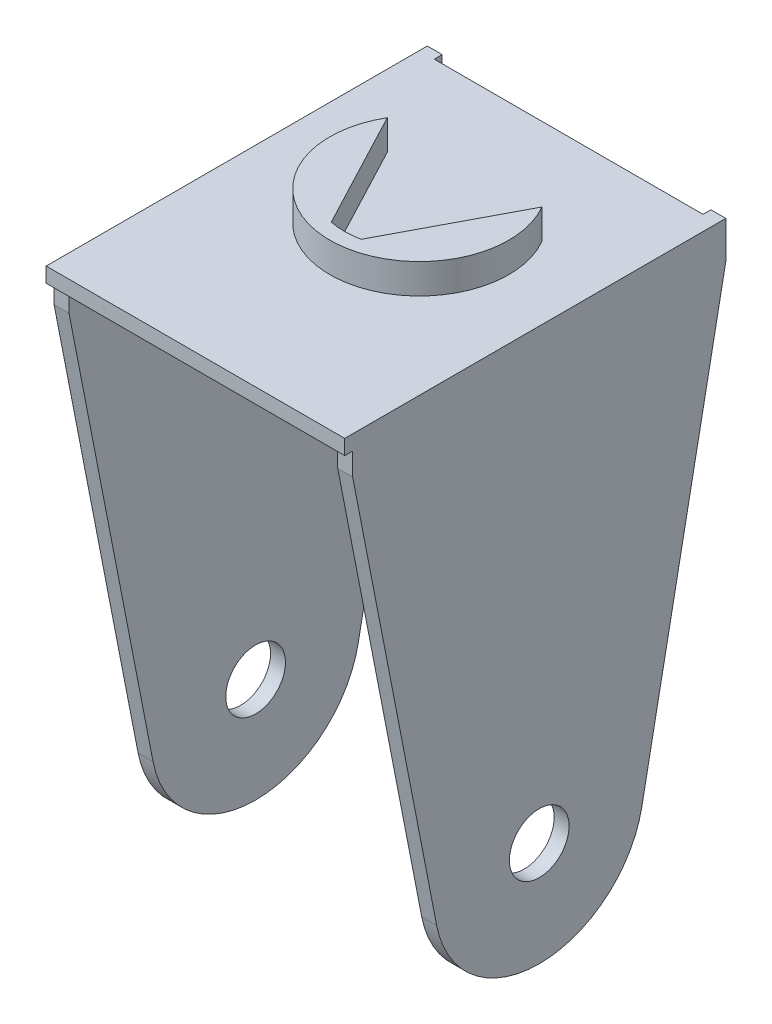
ISO-10303-21;
HEADER;
FILE_DESCRIPTION(('STEP AP214'),'2;1');
FILE_NAME('part.step','',(''),(''),'','','');
FILE_SCHEMA(('AUTOMOTIVE_DESIGN { 1 0 10303 214 1 1 1 1 }'));
ENDSEC;
DATA;
#1=APPLICATION_CONTEXT('core data for automotive mechanical design processes');
#2=APPLICATION_PROTOCOL_DEFINITION('international standard','automotive_design',2000,#1);
#3=PRODUCT_CONTEXT('',#1,'mechanical');
#4=PRODUCT('Part','Part','',(#3));
#5=PRODUCT_RELATED_PRODUCT_CATEGORY('part','',(#4));
#6=PRODUCT_DEFINITION_FORMATION('','',#4);
#7=PRODUCT_DEFINITION_CONTEXT('part definition',#1,'design');
#8=PRODUCT_DEFINITION('design','',#6,#7);
#9=PRODUCT_DEFINITION_SHAPE('','',#8);
#10=(LENGTH_UNIT() NAMED_UNIT(*) SI_UNIT(.MILLI.,.METRE.));
#11=(NAMED_UNIT(*) PLANE_ANGLE_UNIT() SI_UNIT($,.RADIAN.));
#12=(NAMED_UNIT(*) SI_UNIT($,.STERADIAN.) SOLID_ANGLE_UNIT());
#13=UNCERTAINTY_MEASURE_WITH_UNIT(LENGTH_MEASURE(1.E-05),#10,'distance_accuracy_value','');
#14=(GEOMETRIC_REPRESENTATION_CONTEXT(3) GLOBAL_UNCERTAINTY_ASSIGNED_CONTEXT((#13)) GLOBAL_UNIT_ASSIGNED_CONTEXT((#10,
#11,#12)) REPRESENTATION_CONTEXT('',''));
#15=CARTESIAN_POINT('',(0.,0.,0.));
#16=DIRECTION('',(0.,0.,1.));
#17=DIRECTION('',(1.,0.,0.));
#18=AXIS2_PLACEMENT_3D('',#15,#16,#17);
#19=CARTESIAN_POINT('',(-2.,57.2753057698561,0.));
#20=DIRECTION('',(0.,-1.,0.));
#21=DIRECTION('',(0.,0.,-1.));
#22=AXIS2_PLACEMENT_3D('',#19,#20,#21);
#23=PLANE('',#22);
#24=DIRECTION('',(0.,0.,1.));
#25=VECTOR('',#24,1.);
#26=CARTESIAN_POINT('',(-40.,57.2753057698561,-44.4543338172952));
#27=LINE('',#26,#25);
#28=CARTESIAN_POINT('',(-40.,57.2753057698561,-45.5140753862794));
#29=VERTEX_POINT('',#28);
#30=CARTESIAN_POINT('',(-40.,57.2753057698561,5.54566618270477));
#31=VERTEX_POINT('',#30);
#32=EDGE_CURVE('E247',#29,#31,#27,.T.);
#33=ORIENTED_EDGE('',*,*,#32,.T.);
#34=DIRECTION('',(1.,0.,0.));
#35=VECTOR('',#34,1.);
#36=CARTESIAN_POINT('',(-40.,57.2753057698561,5.54566618270477));
#37=LINE('',#36,#35);
#38=CARTESIAN_POINT('',(0.,57.2753057698561,5.54566618270477));
#39=VERTEX_POINT('',#38);
#40=EDGE_CURVE('E262',#31,#39,#37,.T.);
#41=ORIENTED_EDGE('',*,*,#40,.T.);
#42=DIRECTION('',(0.,0.,-1.));
#43=VECTOR('',#42,1.);
#44=CARTESIAN_POINT('',(0.,57.2753057698561,0.));
#45=LINE('',#44,#43);
#46=CARTESIAN_POINT('',(0.,57.2753057698561,-45.5140753862794));
#47=VERTEX_POINT('',#46);
#48=EDGE_CURVE('E305',#39,#47,#45,.T.);
#49=ORIENTED_EDGE('',*,*,#48,.T.);
#50=DIRECTION('',(1.,0.,0.));
#51=VECTOR('',#50,1.);
#52=CARTESIAN_POINT('',(-2.,57.2753057698561,-45.5140753862794));
#53=LINE('',#52,#51);
#54=CARTESIAN_POINT('',(-2.,57.2753057698561,-45.5140753862794));
#55=VERTEX_POINT('',#54);
#56=EDGE_CURVE('E314',#55,#47,#53,.T.);
#57=ORIENTED_EDGE('',*,*,#56,.F.);
#58=DIRECTION('',(0.,0.,-1.));
#59=VECTOR('',#58,1.);
#60=CARTESIAN_POINT('',(-2.,57.2753057698561,0.));
#61=LINE('',#60,#59);
#62=CARTESIAN_POINT('',(-2.,57.2753057698561,-44.4543338172952));
#63=VERTEX_POINT('',#62);
#64=EDGE_CURVE('E290',#63,#55,#61,.T.);
#65=ORIENTED_EDGE('',*,*,#64,.F.);
#66=DIRECTION('',(-1.,0.,0.));
#67=VECTOR('',#66,1.);
#68=CARTESIAN_POINT('',(-40.,57.2753057698561,-44.4543338172952));
#69=LINE('',#68,#67);
#70=CARTESIAN_POINT('',(-38.,57.2753057698561,-44.4543338172952));
#71=VERTEX_POINT('',#70);
#72=EDGE_CURVE('E251',#63,#71,#69,.T.);
#73=ORIENTED_EDGE('',*,*,#72,.T.);
#74=DIRECTION('',(0.,0.,-1.));
#75=VECTOR('',#74,1.);
#76=CARTESIAN_POINT('',(-38.,57.2753057698561,0.));
#77=LINE('',#76,#75);
#78=CARTESIAN_POINT('',(-38.,57.2753057698561,-45.5140753862794));
#79=VERTEX_POINT('',#78);
#80=EDGE_CURVE('E210',#71,#79,#77,.T.);
#81=ORIENTED_EDGE('',*,*,#80,.T.);
#82=DIRECTION('',(-1.,0.,0.));
#83=VECTOR('',#82,1.);
#84=CARTESIAN_POINT('',(-38.,57.2753057698561,-45.5140753862794));
#85=LINE('',#84,#83);
#86=EDGE_CURVE('E234',#79,#29,#85,.T.);
#87=ORIENTED_EDGE('',*,*,#86,.T.);
#88=EDGE_LOOP('',(#33,#41,#49,#57,#65,#73,#81,#87));
#89=FACE_BOUND('',#88,.T.);
#90=CARTESIAN_POINT('',(-20.,57.2753057698561,-24.4518975597883));
#91=DIRECTION('',(0.,-1.,0.));
#92=DIRECTION('',(0.,0.,1.));
#93=AXIS2_PLACEMENT_3D('',#90,#91,#92);
#94=CIRCLE('',#93,10.);
#95=CARTESIAN_POINT('',(-18.,57.2753057698561,-14.6539385886556));
#96=VERTEX_POINT('',#95);
#97=CARTESIAN_POINT('',(-22.,57.2753057698561,-14.6539385886556));
#98=VERTEX_POINT('',#97);
#99=EDGE_CURVE('E51',#96,#98,#94,.T.);
#100=ORIENTED_EDGE('',*,*,#99,.F.);
#101=DIRECTION('',(-0.466127174450924,0.,0.884717727435365));
#102=VECTOR('',#101,1.);
#103=CARTESIAN_POINT('',(-18.,57.2753057698561,-14.6539385886556));
#104=LINE('',#103,#102);
#105=CARTESIAN_POINT('',(-9.64384241139601,57.2753057698561,-30.5140753862794));
#106=VERTEX_POINT('',#105);
#107=EDGE_CURVE('E55',#106,#96,#104,.T.);
#108=ORIENTED_EDGE('',*,*,#107,.F.);
#109=CARTESIAN_POINT('',(-20.,57.2753057698561,-24.4518975597883));
#110=DIRECTION('',(0.,1.,0.));
#111=DIRECTION('',(0.,0.,1.));
#112=AXIS2_PLACEMENT_3D('',#109,#110,#111);
#113=CIRCLE('',#112,12.);
#114=CARTESIAN_POINT('',(-30.356157588604,57.2753057698561,-30.5140753862794));
#115=VERTEX_POINT('',#114);
#116=EDGE_CURVE('E461',#115,#106,#113,.T.);
#117=ORIENTED_EDGE('',*,*,#116,.F.);
#118=DIRECTION('',(-0.466127174450924,0.,-0.884717727435365));
#119=VECTOR('',#118,1.);
#120=CARTESIAN_POINT('',(-22.,57.2753057698561,-14.6539385886556));
#121=LINE('',#120,#119);
#122=EDGE_CURVE('E459',#98,#115,#121,.T.);
#123=ORIENTED_EDGE('',*,*,#122,.F.);
#124=EDGE_LOOP('',(#100,#108,#117,#123));
#125=FACE_BOUND('',#124,.T.);
#126=ADVANCED_FACE('F35',(#89,#125),#23,.F.);
#127=CARTESIAN_POINT('',(-40.,55.2753057698561,-44.4543338172952));
#128=DIRECTION('',(0.,0.,-1.));
#129=DIRECTION('',(-1.,0.,0.));
#130=AXIS2_PLACEMENT_3D('',#127,#128,#129);
#131=PLANE('',#130);
#132=DIRECTION('',(-1.,0.,0.));
#133=VECTOR('',#132,1.);
#134=CARTESIAN_POINT('',(-40.,55.2753057698561,-44.4543338172952));
#135=LINE('',#134,#133);
#136=CARTESIAN_POINT('',(-2.,55.2753057698561,-44.4543338172952));
#137=VERTEX_POINT('',#136);
#138=CARTESIAN_POINT('',(-38.,55.2753057698561,-44.4543338172952));
#139=VERTEX_POINT('',#138);
#140=EDGE_CURVE('E257',#137,#139,#135,.T.);
#141=ORIENTED_EDGE('',*,*,#140,.T.);
#142=DIRECTION('',(0.,1.,0.));
#143=VECTOR('',#142,1.);
#144=CARTESIAN_POINT('',(-38.,55.2753057698561,-44.4543338172952));
#145=LINE('',#144,#143);
#146=EDGE_CURVE('E244',#139,#71,#145,.T.);
#147=ORIENTED_EDGE('',*,*,#146,.T.);
#148=ORIENTED_EDGE('',*,*,#72,.F.);
#149=DIRECTION('',(0.,1.,0.));
#150=VECTOR('',#149,1.);
#151=CARTESIAN_POINT('',(-2.,0.,-44.4543338172952));
#152=LINE('',#151,#150);
#153=EDGE_CURVE('E278',#137,#63,#152,.T.);
#154=ORIENTED_EDGE('',*,*,#153,.F.);
#155=EDGE_LOOP('',(#141,#147,#148,#154));
#156=FACE_BOUND('',#155,.T.);
#157=ADVANCED_FACE('F351',(#156),#131,.T.);
#158=CARTESIAN_POINT('',(0.,55.2753057698561,0.));
#159=DIRECTION('',(0.,1.,0.));
#160=DIRECTION('',(0.,0.,1.));
#161=AXIS2_PLACEMENT_3D('',#158,#159,#160);
#162=PLANE('',#161);
#163=DIRECTION('',(-1.,0.,0.));
#164=VECTOR('',#163,1.);
#165=CARTESIAN_POINT('',(0.,55.2753057698561,4.48592461372064));
#166=LINE('',#165,#164);
#167=CARTESIAN_POINT('',(-38.,55.2753057698561,4.48592461372064));
#168=VERTEX_POINT('',#167);
#169=CARTESIAN_POINT('',(-40.,55.2753057698561,4.48592461372063));
#170=VERTEX_POINT('',#169);
#171=EDGE_CURVE('E230',#168,#170,#166,.T.);
#172=ORIENTED_EDGE('',*,*,#171,.F.);
#173=DIRECTION('',(0.,0.,1.));
#174=VECTOR('',#173,1.);
#175=CARTESIAN_POINT('',(-38.,55.2753057698561,0.));
#176=LINE('',#175,#174);
#177=EDGE_CURVE('E11',#139,#168,#176,.T.);
#178=ORIENTED_EDGE('',*,*,#177,.F.);
#179=ORIENTED_EDGE('',*,*,#140,.F.);
#180=DIRECTION('',(0.,0.,1.));
#181=VECTOR('',#180,1.);
#182=CARTESIAN_POINT('',(-2.,55.2753057698561,0.));
#183=LINE('',#182,#181);
#184=CARTESIAN_POINT('',(-2.,55.2753057698561,4.48592461372064));
#185=VERTEX_POINT('',#184);
#186=EDGE_CURVE('E270',#137,#185,#183,.T.);
#187=ORIENTED_EDGE('',*,*,#186,.T.);
#188=DIRECTION('',(1.,0.,0.));
#189=VECTOR('',#188,1.);
#190=CARTESIAN_POINT('',(-2.,55.2753057698561,4.48592461372064));
#191=LINE('',#190,#189);
#192=CARTESIAN_POINT('',(0.,55.2753057698561,4.48592461372064));
#193=VERTEX_POINT('',#192);
#194=EDGE_CURVE('E275',#185,#193,#191,.T.);
#195=ORIENTED_EDGE('',*,*,#194,.T.);
#196=DIRECTION('',(0.,0.,-1.));
#197=VECTOR('',#196,1.);
#198=CARTESIAN_POINT('',(0.,55.2753057698561,-44.4543338172952));
#199=LINE('',#198,#197);
#200=CARTESIAN_POINT('',(0.,55.2753057698561,5.54566618270477));
#201=VERTEX_POINT('',#200);
#202=EDGE_CURVE('E254',#201,#193,#199,.T.);
#203=ORIENTED_EDGE('',*,*,#202,.F.);
#204=DIRECTION('',(1.,0.,0.));
#205=VECTOR('',#204,1.);
#206=CARTESIAN_POINT('',(-40.,55.2753057698561,5.54566618270477));
#207=LINE('',#206,#205);
#208=CARTESIAN_POINT('',(-40.,55.2753057698561,5.54566618270477));
#209=VERTEX_POINT('',#208);
#210=EDGE_CURVE('E250',#209,#201,#207,.T.);
#211=ORIENTED_EDGE('',*,*,#210,.F.);
#212=DIRECTION('',(0.,0.,1.));
#213=VECTOR('',#212,1.);
#214=CARTESIAN_POINT('',(-40.,55.2753057698561,-44.4543338172952));
#215=LINE('',#214,#213);
#216=EDGE_CURVE('E248',#170,#209,#215,.T.);
#217=ORIENTED_EDGE('',*,*,#216,.F.);
#218=EDGE_LOOP('',(#172,#178,#179,#187,#195,#203,#211,#217));
#219=FACE_BOUND('',#218,.T.);
#220=ADVANCED_FACE('F347',(#219),#162,.F.);
#221=CARTESIAN_POINT('',(-2.,0.,4.48592461372065));
#222=DIRECTION('',(0.,0.,-1.));
#223=DIRECTION('',(0.,1.,0.));
#224=AXIS2_PLACEMENT_3D('',#221,#222,#223);
#225=PLANE('',#224);
#226=ORIENTED_EDGE('',*,*,#194,.F.);
#227=DIRECTION('',(0.,1.,0.));
#228=VECTOR('',#227,1.);
#229=CARTESIAN_POINT('',(-2.,0.,4.48592461372065));
#230=LINE('',#229,#228);
#231=CARTESIAN_POINT('',(-2.,52.2753057698561,4.48592461372064));
#232=VERTEX_POINT('',#231);
#233=EDGE_CURVE('E292',#232,#185,#230,.T.);
#234=ORIENTED_EDGE('',*,*,#233,.F.);
#235=DIRECTION('',(1.,0.,0.));
#236=VECTOR('',#235,1.);
#237=CARTESIAN_POINT('',(-2.,52.2753057698561,4.48592461372064));
#238=LINE('',#237,#236);
#239=CARTESIAN_POINT('',(0.,52.2753057698561,4.48592461372064));
#240=VERTEX_POINT('',#239);
#241=EDGE_CURVE('E311',#232,#240,#238,.T.);
#242=ORIENTED_EDGE('',*,*,#241,.T.);
#243=DIRECTION('',(0.,1.,0.));
#244=VECTOR('',#243,1.);
#245=CARTESIAN_POINT('',(0.,0.,4.48592461372065));
#246=LINE('',#245,#244);
#247=EDGE_CURVE('E307',#240,#193,#246,.T.);
#248=ORIENTED_EDGE('',*,*,#247,.T.);
#249=EDGE_LOOP('',(#226,#234,#242,#248));
#250=FACE_BOUND('',#249,.T.);
#251=ADVANCED_FACE('F340',(#250),#225,.F.);
#252=CARTESIAN_POINT('',(-2.,-2.72469423014387,-20.5140753862794));
#253=DIRECTION('',(1.,0.,0.));
#254=DIRECTION('',(0.,0.,-1.));
#255=AXIS2_PLACEMENT_3D('',#252,#253,#254);
#256=CYLINDRICAL_SURFACE('',#255,14.);
#257=CARTESIAN_POINT('',(0.,-2.72469423014387,-20.5140753862794));
#258=DIRECTION('',(1.,0.,0.));
#259=DIRECTION('',(0.,0.,-1.));
#260=AXIS2_PLACEMENT_3D('',#257,#258,#259);
#261=CIRCLE('',#260,14.);
#262=CARTESIAN_POINT('',(0.,-5.40682008134419,-6.77339851363869));
#263=VERTEX_POINT('',#262);
#264=CARTESIAN_POINT('',(0.,-5.40682008134418,-34.2547522589201));
#265=VERTEX_POINT('',#264);
#266=EDGE_CURVE('E281',#263,#265,#261,.T.);
#267=ORIENTED_EDGE('',*,*,#266,.F.);
#268=DIRECTION('',(1.,0.,0.));
#269=VECTOR('',#268,1.);
#270=CARTESIAN_POINT('',(-2.,-5.40682008134419,-6.77339851363869));
#271=LINE('',#270,#269);
#272=CARTESIAN_POINT('',(-2.,-5.40682008134419,-6.77339851363869));
#273=VERTEX_POINT('',#272);
#274=EDGE_CURVE('E44',#273,#263,#271,.T.);
#275=ORIENTED_EDGE('',*,*,#274,.F.);
#276=CARTESIAN_POINT('',(-2.,-2.72469423014387,-20.5140753862794));
#277=DIRECTION('',(1.,0.,0.));
#278=DIRECTION('',(0.,0.,-1.));
#279=AXIS2_PLACEMENT_3D('',#276,#277,#278);
#280=CIRCLE('',#279,14.);
#281=CARTESIAN_POINT('',(-2.,-5.40682008134418,-34.2547522589201));
#282=VERTEX_POINT('',#281);
#283=EDGE_CURVE('E282',#273,#282,#280,.T.);
#284=ORIENTED_EDGE('',*,*,#283,.T.);
#285=DIRECTION('',(1.,0.,0.));
#286=VECTOR('',#285,1.);
#287=CARTESIAN_POINT('',(-2.,-5.40682008134418,-34.2547522589201));
#288=LINE('',#287,#286);
#289=EDGE_CURVE('E297',#282,#265,#288,.T.);
#290=ORIENTED_EDGE('',*,*,#289,.T.);
#291=EDGE_LOOP('',(#267,#275,#284,#290));
#292=FACE_BOUND('',#291,.T.);
#293=ADVANCED_FACE('F37',(#292),#256,.T.);
#294=CARTESIAN_POINT('',(-2.,1.07516720995228,-5.50814019759788));
#295=DIRECTION('',(0.,0.19158041794288,-0.981476919474335));
#296=DIRECTION('',(0.,0.981476919474336,0.19158041794288));
#297=AXIS2_PLACEMENT_3D('',#294,#295,#296);
#298=PLANE('',#297);
#299=DIRECTION('',(0.,0.981476919474336,0.19158041794288));
#300=VECTOR('',#299,1.);
#301=CARTESIAN_POINT('',(0.,1.07516720995228,-5.50814019759788));
#302=LINE('',#301,#300);
#303=EDGE_CURVE('E286',#263,#240,#302,.T.);
#304=ORIENTED_EDGE('',*,*,#303,.T.);
#305=ORIENTED_EDGE('',*,*,#241,.F.);
#306=DIRECTION('',(0.,0.981476919474336,0.19158041794288));
#307=VECTOR('',#306,1.);
#308=CARTESIAN_POINT('',(-2.,1.07516720995228,-5.50814019759788));
#309=LINE('',#308,#307);
#310=EDGE_CURVE('E295',#273,#232,#309,.T.);
#311=ORIENTED_EDGE('',*,*,#310,.F.);
#312=ORIENTED_EDGE('',*,*,#274,.T.);
#313=EDGE_LOOP('',(#304,#305,#311,#312));
#314=FACE_BOUND('',#313,.T.);
#315=ADVANCED_FACE('F336',(#314),#298,.F.);
#316=CARTESIAN_POINT('',(-2.,0.,-45.5140753862794));
#317=DIRECTION('',(0.,0.,1.));
#318=DIRECTION('',(1.,0.,0.));
#319=AXIS2_PLACEMENT_3D('',#316,#317,#318);
#320=PLANE('',#319);
#321=DIRECTION('',(0.,-1.,0.));
#322=VECTOR('',#321,1.);
#323=CARTESIAN_POINT('',(0.,0.,-45.5140753862794));
#324=LINE('',#323,#322);
#325=CARTESIAN_POINT('',(0.,52.2753057698561,-45.5140753862794));
#326=VERTEX_POINT('',#325);
#327=EDGE_CURVE('E303',#47,#326,#324,.T.);
#328=ORIENTED_EDGE('',*,*,#327,.T.);
#329=DIRECTION('',(1.,0.,0.));
#330=VECTOR('',#329,1.);
#331=CARTESIAN_POINT('',(-2.,52.2753057698561,-45.5140753862794));
#332=LINE('',#331,#330);
#333=CARTESIAN_POINT('',(-2.,52.2753057698561,-45.5140753862794));
#334=VERTEX_POINT('',#333);
#335=EDGE_CURVE('E317',#334,#326,#332,.T.);
#336=ORIENTED_EDGE('',*,*,#335,.F.);
#337=DIRECTION('',(0.,-1.,0.));
#338=VECTOR('',#337,1.);
#339=CARTESIAN_POINT('',(-2.,0.,-45.5140753862794));
#340=LINE('',#339,#338);
#341=EDGE_CURVE('E288',#55,#334,#340,.T.);
#342=ORIENTED_EDGE('',*,*,#341,.F.);
#343=ORIENTED_EDGE('',*,*,#56,.T.);
#344=EDGE_LOOP('',(#328,#336,#342,#343));
#345=FACE_BOUND('',#344,.T.);
#346=ADVANCED_FACE('F357',(#345),#320,.F.);
#347=CARTESIAN_POINT('',(-2.,-6.63942812511474,-34.0141520374581));
#348=DIRECTION('',(0.,0.19158041794288,0.981476919474336));
#349=DIRECTION('',(0.,-0.981476919474336,0.19158041794288));
#350=AXIS2_PLACEMENT_3D('',#347,#348,#349);
#351=PLANE('',#350);
#352=DIRECTION('',(0.,-0.981476919474336,0.19158041794288));
#353=VECTOR('',#352,1.);
#354=CARTESIAN_POINT('',(0.,-6.63942812511474,-34.0141520374581));
#355=LINE('',#354,#353);
#356=EDGE_CURVE('E300',#326,#265,#355,.T.);
#357=ORIENTED_EDGE('',*,*,#356,.T.);
#358=ORIENTED_EDGE('',*,*,#289,.F.);
#359=DIRECTION('',(0.,-0.981476919474336,0.19158041794288));
#360=VECTOR('',#359,1.);
#361=CARTESIAN_POINT('',(-2.,-6.63942812511474,-34.0141520374581));
#362=LINE('',#361,#360);
#363=EDGE_CURVE('E285',#334,#282,#362,.T.);
#364=ORIENTED_EDGE('',*,*,#363,.F.);
#365=ORIENTED_EDGE('',*,*,#335,.T.);
#366=EDGE_LOOP('',(#357,#358,#364,#365));
#367=FACE_BOUND('',#366,.T.);
#368=ADVANCED_FACE('F327',(#367),#351,.F.);
#369=CARTESIAN_POINT('',(-2.,0.,0.));
#370=DIRECTION('',(1.,0.,0.));
#371=DIRECTION('',(0.,0.,-1.));
#372=AXIS2_PLACEMENT_3D('',#369,#370,#371);
#373=PLANE('',#372);
#374=CARTESIAN_POINT('',(-2.,-2.72469423014387,-20.5140753862794));
#375=DIRECTION('',(1.,0.,0.));
#376=DIRECTION('',(0.,0.,-1.));
#377=AXIS2_PLACEMENT_3D('',#374,#375,#376);
#378=CIRCLE('',#377,4.);
#379=CARTESIAN_POINT('',(-2.,-2.72469423014387,-24.5140753862794));
#380=VERTEX_POINT('',#379);
#381=EDGE_CURVE('E450',#380,#380,#378,.T.);
#382=ORIENTED_EDGE('',*,*,#381,.T.);
#383=EDGE_LOOP('',(#382));
#384=FACE_BOUND('',#383,.T.);
#385=ORIENTED_EDGE('',*,*,#186,.F.);
#386=ORIENTED_EDGE('',*,*,#153,.T.);
#387=ORIENTED_EDGE('',*,*,#64,.T.);
#388=ORIENTED_EDGE('',*,*,#341,.T.);
#389=ORIENTED_EDGE('',*,*,#363,.T.);
#390=ORIENTED_EDGE('',*,*,#283,.F.);
#391=ORIENTED_EDGE('',*,*,#310,.T.);
#392=ORIENTED_EDGE('',*,*,#233,.T.);
#393=EDGE_LOOP('',(#385,#386,#387,#388,#389,#390,#391,#392));
#394=FACE_BOUND('',#393,.T.);
#395=ADVANCED_FACE('F342',(#384,#394),#373,.F.);
#396=CARTESIAN_POINT('',(0.,0.,0.));
#397=DIRECTION('',(1.,0.,0.));
#398=DIRECTION('',(0.,0.,-1.));
#399=AXIS2_PLACEMENT_3D('',#396,#397,#398);
#400=PLANE('',#399);
#401=CARTESIAN_POINT('',(0.,-2.72469423014387,-20.5140753862794));
#402=DIRECTION('',(1.,0.,0.));
#403=DIRECTION('',(0.,0.,-1.));
#404=AXIS2_PLACEMENT_3D('',#401,#402,#403);
#405=CIRCLE('',#404,4.);
#406=CARTESIAN_POINT('',(0.,-2.72469423014387,-24.5140753862794));
#407=VERTEX_POINT('',#406);
#408=EDGE_CURVE('E447',#407,#407,#405,.T.);
#409=ORIENTED_EDGE('',*,*,#408,.F.);
#410=EDGE_LOOP('',(#409));
#411=FACE_BOUND('',#410,.T.);
#412=ORIENTED_EDGE('',*,*,#327,.F.);
#413=ORIENTED_EDGE('',*,*,#48,.F.);
#414=DIRECTION('',(0.,1.,0.));
#415=VECTOR('',#414,1.);
#416=CARTESIAN_POINT('',(0.,55.2753057698561,5.54566618270477));
#417=LINE('',#416,#415);
#418=EDGE_CURVE('E267',#201,#39,#417,.T.);
#419=ORIENTED_EDGE('',*,*,#418,.F.);
#420=ORIENTED_EDGE('',*,*,#202,.T.);
#421=ORIENTED_EDGE('',*,*,#247,.F.);
#422=ORIENTED_EDGE('',*,*,#303,.F.);
#423=ORIENTED_EDGE('',*,*,#266,.T.);
#424=ORIENTED_EDGE('',*,*,#356,.F.);
#425=EDGE_LOOP('',(#412,#413,#419,#420,#421,#422,#423,#424));
#426=FACE_BOUND('',#425,.T.);
#427=ADVANCED_FACE('F332',(#411,#426),#400,.T.);
#428=CARTESIAN_POINT('',(-40.,55.2753057698561,-44.4543338172952));
#429=DIRECTION('',(-1.,0.,0.));
#430=DIRECTION('',(0.,0.,1.));
#431=AXIS2_PLACEMENT_3D('',#428,#429,#430);
#432=PLANE('',#431);
#433=CARTESIAN_POINT('',(-40.,-2.72469423014387,-20.5140753862794));
#434=DIRECTION('',(1.,0.,0.));
#435=DIRECTION('',(0.,0.,-1.));
#436=AXIS2_PLACEMENT_3D('',#433,#434,#435);
#437=CIRCLE('',#436,4.);
#438=CARTESIAN_POINT('',(-40.,-2.72469423014387,-24.5140753862794));
#439=VERTEX_POINT('',#438);
#440=EDGE_CURVE('E445',#439,#439,#437,.T.);
#441=ORIENTED_EDGE('',*,*,#440,.T.);
#442=EDGE_LOOP('',(#441));
#443=FACE_BOUND('',#442,.T.);
#444=ORIENTED_EDGE('',*,*,#32,.F.);
#445=DIRECTION('',(0.,-1.,0.));
#446=VECTOR('',#445,1.);
#447=CARTESIAN_POINT('',(-40.,0.,-45.5140753862794));
#448=LINE('',#447,#446);
#449=CARTESIAN_POINT('',(-40.,52.2753057698561,-45.5140753862794));
#450=VERTEX_POINT('',#449);
#451=EDGE_CURVE('E220',#29,#450,#448,.T.);
#452=ORIENTED_EDGE('',*,*,#451,.T.);
#453=DIRECTION('',(0.,-0.981476919474336,0.19158041794288));
#454=VECTOR('',#453,1.);
#455=CARTESIAN_POINT('',(-40.,-6.63942812511474,-34.0141520374581));
#456=LINE('',#455,#454);
#457=CARTESIAN_POINT('',(-40.,-5.40682008134418,-34.2547522589201));
#458=VERTEX_POINT('',#457);
#459=EDGE_CURVE('E195',#450,#458,#456,.T.);
#460=ORIENTED_EDGE('',*,*,#459,.T.);
#461=CARTESIAN_POINT('',(-40.,-2.72469423014387,-20.5140753862794));
#462=DIRECTION('',(1.,0.,0.));
#463=DIRECTION('',(0.,0.,-1.));
#464=AXIS2_PLACEMENT_3D('',#461,#462,#463);
#465=CIRCLE('',#464,14.);
#466=CARTESIAN_POINT('',(-40.,-5.40682008134419,-6.77339851363869));
#467=VERTEX_POINT('',#466);
#468=EDGE_CURVE('E192',#467,#458,#465,.T.);
#469=ORIENTED_EDGE('',*,*,#468,.F.);
#470=DIRECTION('',(0.,0.981476919474336,0.19158041794288));
#471=VECTOR('',#470,1.);
#472=CARTESIAN_POINT('',(-40.,1.07516720995228,-5.50814019759788));
#473=LINE('',#472,#471);
#474=CARTESIAN_POINT('',(-40.,52.2753057698561,4.48592461372064));
#475=VERTEX_POINT('',#474);
#476=EDGE_CURVE('E205',#467,#475,#473,.T.);
#477=ORIENTED_EDGE('',*,*,#476,.T.);
#478=DIRECTION('',(0.,1.,0.));
#479=VECTOR('',#478,1.);
#480=CARTESIAN_POINT('',(-40.,0.,4.48592461372065));
#481=LINE('',#480,#479);
#482=EDGE_CURVE('E223',#475,#170,#481,.T.);
#483=ORIENTED_EDGE('',*,*,#482,.T.);
#484=ORIENTED_EDGE('',*,*,#216,.T.);
#485=DIRECTION('',(0.,1.,0.));
#486=VECTOR('',#485,1.);
#487=CARTESIAN_POINT('',(-40.,55.2753057698561,5.54566618270477));
#488=LINE('',#487,#486);
#489=EDGE_CURVE('E260',#209,#31,#488,.T.);
#490=ORIENTED_EDGE('',*,*,#489,.T.);
#491=EDGE_LOOP('',(#444,#452,#460,#469,#477,#483,#484,#490));
#492=FACE_BOUND('',#491,.T.);
#493=ADVANCED_FACE('F366',(#443,#492),#432,.T.);
#494=CARTESIAN_POINT('',(-40.,55.2753057698561,5.54566618270477));
#495=DIRECTION('',(0.,0.,1.));
#496=DIRECTION('',(1.,0.,0.));
#497=AXIS2_PLACEMENT_3D('',#494,#495,#496);
#498=PLANE('',#497);
#499=ORIENTED_EDGE('',*,*,#40,.F.);
#500=ORIENTED_EDGE('',*,*,#489,.F.);
#501=ORIENTED_EDGE('',*,*,#210,.T.);
#502=ORIENTED_EDGE('',*,*,#418,.T.);
#503=EDGE_LOOP('',(#499,#500,#501,#502));
#504=FACE_BOUND('',#503,.T.);
#505=ADVANCED_FACE('F360',(#504),#498,.T.);
#506=CARTESIAN_POINT('',(-38.,0.,4.48592461372065));
#507=DIRECTION('',(0.,0.,-1.));
#508=DIRECTION('',(0.,1.,0.));
#509=AXIS2_PLACEMENT_3D('',#506,#507,#508);
#510=PLANE('',#509);
#511=DIRECTION('',(0.,1.,0.));
#512=VECTOR('',#511,1.);
#513=CARTESIAN_POINT('',(-38.,0.,4.48592461372065));
#514=LINE('',#513,#512);
#515=CARTESIAN_POINT('',(-38.,52.2753057698561,4.48592461372064));
#516=VERTEX_POINT('',#515);
#517=EDGE_CURVE('E212',#516,#168,#514,.T.);
#518=ORIENTED_EDGE('',*,*,#517,.T.);
#519=ORIENTED_EDGE('',*,*,#171,.T.);
#520=ORIENTED_EDGE('',*,*,#482,.F.);
#521=DIRECTION('',(-1.,0.,0.));
#522=VECTOR('',#521,1.);
#523=CARTESIAN_POINT('',(-38.,52.2753057698561,4.48592461372064));
#524=LINE('',#523,#522);
#525=EDGE_CURVE('E231',#516,#475,#524,.T.);
#526=ORIENTED_EDGE('',*,*,#525,.F.);
#527=EDGE_LOOP('',(#518,#519,#520,#526));
#528=FACE_BOUND('',#527,.T.);
#529=ADVANCED_FACE('F369',(#528),#510,.F.);
#530=CARTESIAN_POINT('',(-38.,-2.72469423014387,-20.5140753862794));
#531=DIRECTION('',(-1.,0.,0.));
#532=DIRECTION('',(0.,0.,-1.));
#533=AXIS2_PLACEMENT_3D('',#530,#531,#532);
#534=CYLINDRICAL_SURFACE('',#533,14.);
#535=ORIENTED_EDGE('',*,*,#468,.T.);
#536=DIRECTION('',(-1.,0.,0.));
#537=VECTOR('',#536,1.);
#538=CARTESIAN_POINT('',(-38.,-5.40682008134418,-34.2547522589201));
#539=LINE('',#538,#537);
#540=CARTESIAN_POINT('',(-38.,-5.40682008134418,-34.2547522589201));
#541=VERTEX_POINT('',#540);
#542=EDGE_CURVE('E217',#541,#458,#539,.T.);
#543=ORIENTED_EDGE('',*,*,#542,.F.);
#544=CARTESIAN_POINT('',(-38.,-2.72469423014387,-20.5140753862794));
#545=DIRECTION('',(1.,0.,0.));
#546=DIRECTION('',(0.,0.,-1.));
#547=AXIS2_PLACEMENT_3D('',#544,#545,#546);
#548=CIRCLE('',#547,14.);
#549=CARTESIAN_POINT('',(-38.,-5.40682008134419,-6.77339851363869));
#550=VERTEX_POINT('',#549);
#551=EDGE_CURVE('E201',#550,#541,#548,.T.);
#552=ORIENTED_EDGE('',*,*,#551,.F.);
#553=DIRECTION('',(-1.,0.,0.));
#554=VECTOR('',#553,1.);
#555=CARTESIAN_POINT('',(-38.,-5.40682008134419,-6.77339851363869));
#556=LINE('',#555,#554);
#557=EDGE_CURVE('E227',#550,#467,#556,.T.);
#558=ORIENTED_EDGE('',*,*,#557,.T.);
#559=EDGE_LOOP('',(#535,#543,#552,#558));
#560=FACE_BOUND('',#559,.T.);
#561=ADVANCED_FACE('F384',(#560),#534,.T.);
#562=CARTESIAN_POINT('',(-38.,1.07516720995228,-5.50814019759788));
#563=DIRECTION('',(0.,0.19158041794288,-0.981476919474335));
#564=DIRECTION('',(0.,0.981476919474336,0.19158041794288));
#565=AXIS2_PLACEMENT_3D('',#562,#563,#564);
#566=PLANE('',#565);
#567=ORIENTED_EDGE('',*,*,#476,.F.);
#568=ORIENTED_EDGE('',*,*,#557,.F.);
#569=DIRECTION('',(0.,0.981476919474336,0.19158041794288));
#570=VECTOR('',#569,1.);
#571=CARTESIAN_POINT('',(-38.,1.07516720995228,-5.50814019759788));
#572=LINE('',#571,#570);
#573=EDGE_CURVE('E215',#550,#516,#572,.T.);
#574=ORIENTED_EDGE('',*,*,#573,.T.);
#575=ORIENTED_EDGE('',*,*,#525,.T.);
#576=EDGE_LOOP('',(#567,#568,#574,#575));
#577=FACE_BOUND('',#576,.T.);
#578=ADVANCED_FACE('F386',(#577),#566,.F.);
#579=CARTESIAN_POINT('',(-38.,0.,-45.5140753862794));
#580=DIRECTION('',(0.,0.,1.));
#581=DIRECTION('',(-1.,0.,0.));
#582=AXIS2_PLACEMENT_3D('',#579,#580,#581);
#583=PLANE('',#582);
#584=ORIENTED_EDGE('',*,*,#451,.F.);
#585=ORIENTED_EDGE('',*,*,#86,.F.);
#586=DIRECTION('',(0.,-1.,0.));
#587=VECTOR('',#586,1.);
#588=CARTESIAN_POINT('',(-38.,0.,-45.5140753862794));
#589=LINE('',#588,#587);
#590=CARTESIAN_POINT('',(-38.,52.2753057698561,-45.5140753862794));
#591=VERTEX_POINT('',#590);
#592=EDGE_CURVE('E207',#79,#591,#589,.T.);
#593=ORIENTED_EDGE('',*,*,#592,.T.);
#594=DIRECTION('',(-1.,0.,0.));
#595=VECTOR('',#594,1.);
#596=CARTESIAN_POINT('',(-38.,52.2753057698561,-45.5140753862794));
#597=LINE('',#596,#595);
#598=EDGE_CURVE('E237',#591,#450,#597,.T.);
#599=ORIENTED_EDGE('',*,*,#598,.T.);
#600=EDGE_LOOP('',(#584,#585,#593,#599));
#601=FACE_BOUND('',#600,.T.);
#602=ADVANCED_FACE('F377',(#601),#583,.F.);
#603=CARTESIAN_POINT('',(-38.,-6.63942812511474,-34.0141520374581));
#604=DIRECTION('',(0.,0.19158041794288,0.981476919474336));
#605=DIRECTION('',(0.,-0.981476919474336,0.19158041794288));
#606=AXIS2_PLACEMENT_3D('',#603,#604,#605);
#607=PLANE('',#606);
#608=ORIENTED_EDGE('',*,*,#459,.F.);
#609=ORIENTED_EDGE('',*,*,#598,.F.);
#610=DIRECTION('',(0.,-0.981476919474336,0.19158041794288));
#611=VECTOR('',#610,1.);
#612=CARTESIAN_POINT('',(-38.,-6.63942812511474,-34.0141520374581));
#613=LINE('',#612,#611);
#614=EDGE_CURVE('E204',#591,#541,#613,.T.);
#615=ORIENTED_EDGE('',*,*,#614,.T.);
#616=ORIENTED_EDGE('',*,*,#542,.T.);
#617=EDGE_LOOP('',(#608,#609,#615,#616));
#618=FACE_BOUND('',#617,.T.);
#619=ADVANCED_FACE('F381',(#618),#607,.F.);
#620=CARTESIAN_POINT('',(-38.,0.,0.));
#621=DIRECTION('',(-1.,0.,0.));
#622=DIRECTION('',(0.,0.,-1.));
#623=AXIS2_PLACEMENT_3D('',#620,#621,#622);
#624=PLANE('',#623);
#625=CARTESIAN_POINT('',(-38.,-2.72469423014387,-20.5140753862794));
#626=DIRECTION('',(-1.,0.,0.));
#627=DIRECTION('',(0.,0.,1.));
#628=AXIS2_PLACEMENT_3D('',#625,#626,#627);
#629=CIRCLE('',#628,4.);
#630=CARTESIAN_POINT('',(-38.,-2.72469423014387,-16.5140753862794));
#631=VERTEX_POINT('',#630);
#632=EDGE_CURVE('E39',#631,#631,#629,.T.);
#633=ORIENTED_EDGE('',*,*,#632,.T.);
#634=EDGE_LOOP('',(#633));
#635=FACE_BOUND('',#634,.T.);
#636=ORIENTED_EDGE('',*,*,#146,.F.);
#637=ORIENTED_EDGE('',*,*,#177,.T.);
#638=ORIENTED_EDGE('',*,*,#517,.F.);
#639=ORIENTED_EDGE('',*,*,#573,.F.);
#640=ORIENTED_EDGE('',*,*,#551,.T.);
#641=ORIENTED_EDGE('',*,*,#614,.F.);
#642=ORIENTED_EDGE('',*,*,#592,.F.);
#643=ORIENTED_EDGE('',*,*,#80,.F.);
#644=EDGE_LOOP('',(#636,#637,#638,#639,#640,#641,#642,#643));
#645=FACE_BOUND('',#644,.T.);
#646=ADVANCED_FACE('F372',(#635,#645),#624,.F.);
#647=CARTESIAN_POINT('',(-20.,61.2753057698561,-24.4518975597883));
#648=DIRECTION('',(0.,-1.,0.));
#649=DIRECTION('',(0.,0.,-1.));
#650=AXIS2_PLACEMENT_3D('',#647,#648,#649);
#651=CYLINDRICAL_SURFACE('',#650,10.);
#652=ORIENTED_EDGE('',*,*,#99,.T.);
#653=DIRECTION('',(0.,-1.,0.));
#654=VECTOR('',#653,1.);
#655=CARTESIAN_POINT('',(-22.,61.2753057698561,-14.6539385886556));
#656=LINE('',#655,#654);
#657=CARTESIAN_POINT('',(-22.,61.2753057698561,-14.6539385886556));
#658=VERTEX_POINT('',#657);
#659=EDGE_CURVE('E175',#658,#98,#656,.T.);
#660=ORIENTED_EDGE('',*,*,#659,.F.);
#661=CARTESIAN_POINT('',(-20.,61.2753057698561,-24.4518975597883));
#662=DIRECTION('',(0.,-1.,0.));
#663=DIRECTION('',(0.,0.,1.));
#664=AXIS2_PLACEMENT_3D('',#661,#662,#663);
#665=CIRCLE('',#664,10.);
#666=CARTESIAN_POINT('',(-18.,61.2753057698561,-14.6539385886556));
#667=VERTEX_POINT('',#666);
#668=EDGE_CURVE('E181',#667,#658,#665,.T.);
#669=ORIENTED_EDGE('',*,*,#668,.F.);
#670=DIRECTION('',(0.,-1.,0.));
#671=VECTOR('',#670,1.);
#672=CARTESIAN_POINT('',(-18.,61.2753057698561,-14.6539385886556));
#673=LINE('',#672,#671);
#674=EDGE_CURVE('E457',#667,#96,#673,.T.);
#675=ORIENTED_EDGE('',*,*,#674,.T.);
#676=EDGE_LOOP('',(#652,#660,#669,#675));
#677=FACE_BOUND('',#676,.T.);
#678=ADVANCED_FACE('F191',(#677),#651,.F.);
#679=CARTESIAN_POINT('',(-22.,61.2753057698561,-14.6539385886556));
#680=DIRECTION('',(-0.884717727435366,0.,0.466127174450924));
#681=DIRECTION('',(0.466127174450924,0.,0.884717727435366));
#682=AXIS2_PLACEMENT_3D('',#679,#680,#681);
#683=PLANE('',#682);
#684=ORIENTED_EDGE('',*,*,#122,.T.);
#685=DIRECTION('',(0.,-1.,0.));
#686=VECTOR('',#685,1.);
#687=CARTESIAN_POINT('',(-30.356157588604,61.2753057698561,-30.5140753862794));
#688=LINE('',#687,#686);
#689=CARTESIAN_POINT('',(-30.356157588604,61.2753057698561,-30.5140753862794));
#690=VERTEX_POINT('',#689);
#691=EDGE_CURVE('E177',#690,#115,#688,.T.);
#692=ORIENTED_EDGE('',*,*,#691,.F.);
#693=DIRECTION('',(-0.466127174450924,0.,-0.884717727435365));
#694=VECTOR('',#693,1.);
#695=CARTESIAN_POINT('',(-22.,61.2753057698561,-14.6539385886556));
#696=LINE('',#695,#694);
#697=EDGE_CURVE('E170',#658,#690,#696,.T.);
#698=ORIENTED_EDGE('',*,*,#697,.F.);
#699=ORIENTED_EDGE('',*,*,#659,.T.);
#700=EDGE_LOOP('',(#684,#692,#698,#699));
#701=FACE_BOUND('',#700,.T.);
#702=ADVANCED_FACE('F173',(#701),#683,.F.);
#703=CARTESIAN_POINT('',(-20.,61.2753057698561,-24.4518975597883));
#704=DIRECTION('',(0.,-1.,0.));
#705=DIRECTION('',(0.,0.,-1.));
#706=AXIS2_PLACEMENT_3D('',#703,#704,#705);
#707=CYLINDRICAL_SURFACE('',#706,12.);
#708=ORIENTED_EDGE('',*,*,#116,.T.);
#709=DIRECTION('',(0.,-1.,0.));
#710=VECTOR('',#709,1.);
#711=CARTESIAN_POINT('',(-9.64384241139601,61.2753057698561,-30.5140753862794));
#712=LINE('',#711,#710);
#713=CARTESIAN_POINT('',(-9.64384241139601,61.2753057698561,-30.5140753862794));
#714=VERTEX_POINT('',#713);
#715=EDGE_CURVE('E197',#714,#106,#712,.T.);
#716=ORIENTED_EDGE('',*,*,#715,.F.);
#717=CARTESIAN_POINT('',(-20.,61.2753057698561,-24.4518975597883));
#718=DIRECTION('',(0.,1.,0.));
#719=DIRECTION('',(0.,0.,1.));
#720=AXIS2_PLACEMENT_3D('',#717,#718,#719);
#721=CIRCLE('',#720,12.);
#722=EDGE_CURVE('E180',#690,#714,#721,.T.);
#723=ORIENTED_EDGE('',*,*,#722,.F.);
#724=ORIENTED_EDGE('',*,*,#691,.T.);
#725=EDGE_LOOP('',(#708,#716,#723,#724));
#726=FACE_BOUND('',#725,.T.);
#727=ADVANCED_FACE('F469',(#726),#707,.T.);
#728=CARTESIAN_POINT('',(-18.,61.2753057698561,-14.6539385886556));
#729=DIRECTION('',(0.884717727435366,0.,0.466127174450924));
#730=DIRECTION('',(0.466127174450924,0.,-0.884717727435366));
#731=AXIS2_PLACEMENT_3D('',#728,#729,#730);
#732=PLANE('',#731);
#733=ORIENTED_EDGE('',*,*,#107,.T.);
#734=ORIENTED_EDGE('',*,*,#674,.F.);
#735=DIRECTION('',(-0.466127174450924,0.,0.884717727435365));
#736=VECTOR('',#735,1.);
#737=CARTESIAN_POINT('',(-18.,61.2753057698561,-14.6539385886556));
#738=LINE('',#737,#736);
#739=EDGE_CURVE('E186',#714,#667,#738,.T.);
#740=ORIENTED_EDGE('',*,*,#739,.F.);
#741=ORIENTED_EDGE('',*,*,#715,.T.);
#742=EDGE_LOOP('',(#733,#734,#740,#741));
#743=FACE_BOUND('',#742,.T.);
#744=ADVANCED_FACE('F467',(#743),#732,.F.);
#745=CARTESIAN_POINT('',(-20.,61.2753057698561,-24.4518975597883));
#746=DIRECTION('',(0.,1.,0.));
#747=DIRECTION('',(0.,0.,1.));
#748=AXIS2_PLACEMENT_3D('',#745,#746,#747);
#749=PLANE('',#748);
#750=ORIENTED_EDGE('',*,*,#668,.T.);
#751=ORIENTED_EDGE('',*,*,#697,.T.);
#752=ORIENTED_EDGE('',*,*,#722,.T.);
#753=ORIENTED_EDGE('',*,*,#739,.T.);
#754=EDGE_LOOP('',(#750,#751,#752,#753));
#755=FACE_BOUND('',#754,.T.);
#756=ADVANCED_FACE('F184',(#755),#749,.T.);
#757=CARTESIAN_POINT('',(-40.,-2.72469423014387,-20.5140753862794));
#758=DIRECTION('',(1.,0.,0.));
#759=DIRECTION('',(0.,0.,-1.));
#760=AXIS2_PLACEMENT_3D('',#757,#758,#759);
#761=CYLINDRICAL_SURFACE('',#760,4.);
#762=ORIENTED_EDGE('',*,*,#440,.F.);
#763=EDGE_LOOP('',(#762));
#764=FACE_BOUND('',#763,.T.);
#765=ORIENTED_EDGE('',*,*,#632,.F.);
#766=EDGE_LOOP('',(#765));
#767=FACE_BOUND('',#766,.T.);
#768=ADVANCED_FACE('F488',(#764,#767),#761,.F.);
#769=ORIENTED_EDGE('',*,*,#408,.T.);
#770=EDGE_LOOP('',(#769));
#771=FACE_BOUND('',#770,.T.);
#772=ORIENTED_EDGE('',*,*,#381,.F.);
#773=EDGE_LOOP('',(#772));
#774=FACE_BOUND('',#773,.T.);
#775=ADVANCED_FACE('F490',(#771,#774),#761,.F.);
#776=CLOSED_SHELL('',(#126,#157,#220,#251,#293,#315,#346,#368,#395,#427,#493,#505,#529,#561,
#578,#602,#619,#646,#678,#702,#727,#744,#756,#768,#775));
#777=MANIFOLD_SOLID_BREP('B2',#776);
#778=ADVANCED_BREP_SHAPE_REPRESENTATION('',(#18,#777),#14);
#779=SHAPE_DEFINITION_REPRESENTATION(#9,#778);
ENDSEC;
END-ISO-10303-21;
